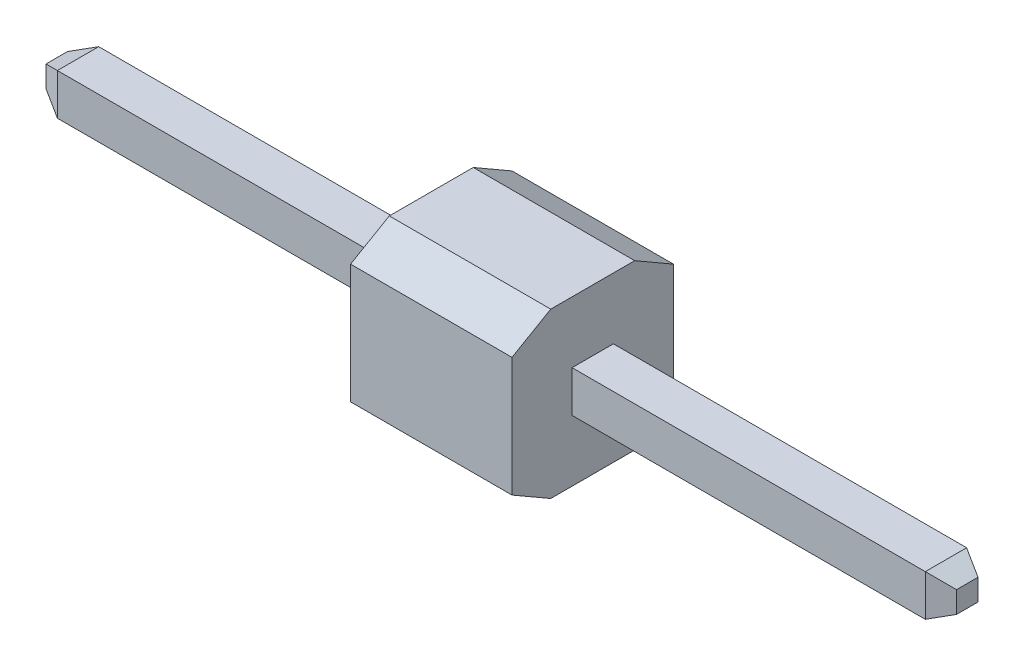
ISO-10303-21;
HEADER;
FILE_DESCRIPTION(('STEP AP214'),'2;1');
FILE_NAME('part.step','',(''),(''),'','','');
FILE_SCHEMA(('AUTOMOTIVE_DESIGN { 1 0 10303 214 1 1 1 1 }'));
ENDSEC;
DATA;
#1=APPLICATION_CONTEXT('core data for automotive mechanical design processes');
#2=APPLICATION_PROTOCOL_DEFINITION('international standard','automotive_design',2000,#1);
#3=PRODUCT_CONTEXT('',#1,'mechanical');
#4=PRODUCT('Part','Part','',(#3));
#5=PRODUCT_RELATED_PRODUCT_CATEGORY('part','',(#4));
#6=PRODUCT_DEFINITION_FORMATION('','',#4);
#7=PRODUCT_DEFINITION_CONTEXT('part definition',#1,'design');
#8=PRODUCT_DEFINITION('design','',#6,#7);
#9=PRODUCT_DEFINITION_SHAPE('','',#8);
#10=(LENGTH_UNIT() NAMED_UNIT(*) SI_UNIT(.MILLI.,.METRE.));
#11=(NAMED_UNIT(*) PLANE_ANGLE_UNIT() SI_UNIT($,.RADIAN.));
#12=(NAMED_UNIT(*) SI_UNIT($,.STERADIAN.) SOLID_ANGLE_UNIT());
#13=UNCERTAINTY_MEASURE_WITH_UNIT(LENGTH_MEASURE(1.E-05),#10,'distance_accuracy_value','');
#14=(GEOMETRIC_REPRESENTATION_CONTEXT(3) GLOBAL_UNCERTAINTY_ASSIGNED_CONTEXT((#13)) GLOBAL_UNIT_ASSIGNED_CONTEXT((#10,
#11,#12)) REPRESENTATION_CONTEXT('',''));
#15=CARTESIAN_POINT('',(0.,0.,0.));
#16=DIRECTION('',(0.,0.,1.));
#17=DIRECTION('',(1.,0.,0.));
#18=AXIS2_PLACEMENT_3D('',#15,#16,#17);
#19=CARTESIAN_POINT('',(5.42107550068064,-13.0171282629139,0.629998634255617));
#20=DIRECTION('',(1.,4.37113882867379E-08,-4.37113882867379E-08));
#21=DIRECTION('',(-4.37113882867379E-08,1.,0.));
#22=AXIS2_PLACEMENT_3D('',#19,#20,#21);
#23=PLANE('',#22);
#24=DIRECTION('',(1.59994777304463E-08,0.50000000000019,0.866025403784329));
#25=VECTOR('',#24,1.);
#26=CARTESIAN_POINT('',(5.42107537769472,-11.7735384244239,-0.940001365744382));
#27=LINE('',#26,#25);
#28=CARTESIAN_POINT('',(5.42107537769472,-11.7735384244239,-0.940001365744382));
#29=VERTEX_POINT('',#28);
#30=CARTESIAN_POINT('',(5.42107538877949,-11.4271282629139,-0.340001365744383));
#31=VERTEX_POINT('',#30);
#32=EDGE_CURVE('E11',#29,#31,#27,.T.);
#33=ORIENTED_EDGE('',*,*,#32,.T.);
#34=DIRECTION('',(4.37113880134522E-08,0.,0.999999999999999));
#35=VECTOR('',#34,1.);
#36=CARTESIAN_POINT('',(5.42107538877949,-11.4271282629139,-0.340001365744383));
#37=LINE('',#36,#35);
#38=CARTESIAN_POINT('',(5.42107544560429,-11.4271282629139,0.959998634255618));
#39=VERTEX_POINT('',#38);
#40=EDGE_CURVE('E304',#31,#39,#37,.T.);
#41=ORIENTED_EDGE('',*,*,#40,.T.);
#42=DIRECTION('',(5.97108681645512E-08,-0.500000000000186,0.86602540378433));
#43=VECTOR('',#42,1.);
#44=CARTESIAN_POINT('',(5.42107544560429,-11.4271282629139,0.959998634255618));
#45=LINE('',#44,#43);
#46=CARTESIAN_POINT('',(5.42107548697319,-11.7735384244239,1.55999863425562));
#47=VERTEX_POINT('',#46);
#48=EDGE_CURVE('E296',#39,#47,#45,.T.);
#49=ORIENTED_EDGE('',*,*,#48,.T.);
#50=DIRECTION('',(4.37113884815545E-08,-0.999999999999999,0.));
#51=VECTOR('',#50,1.);
#52=CARTESIAN_POINT('',(5.42107548697319,-11.7735384244239,1.55999863425562));
#53=LINE('',#52,#51);
#54=CARTESIAN_POINT('',(5.42107556771598,-13.6207181013939,1.55999863425562));
#55=VERTEX_POINT('',#54);
#56=EDGE_CURVE('E281',#47,#55,#53,.T.);
#57=ORIENTED_EDGE('',*,*,#56,.T.);
#58=DIRECTION('',(1.59994802942811E-08,0.500000000000195,0.866025403784326));
#59=VECTOR('',#58,1.);
#60=CARTESIAN_POINT('',(5.42107555663122,-13.9671282629139,0.959998634255618));
#61=LINE('',#60,#59);
#62=CARTESIAN_POINT('',(5.42107555663122,-13.9671282629139,0.959998634255618));
#63=VERTEX_POINT('',#62);
#64=EDGE_CURVE('E265',#63,#55,#61,.T.);
#65=ORIENTED_EDGE('',*,*,#64,.F.);
#66=DIRECTION('',(4.37113880134522E-08,0.,0.999999999999999));
#67=VECTOR('',#66,1.);
#68=CARTESIAN_POINT('',(5.42107549980641,-13.9671282629139,-0.340001365744383));
#69=LINE('',#68,#67);
#70=CARTESIAN_POINT('',(5.42107549980641,-13.9671282629139,-0.340001365744383));
#71=VERTEX_POINT('',#70);
#72=EDGE_CURVE('E248',#71,#63,#69,.T.);
#73=ORIENTED_EDGE('',*,*,#72,.F.);
#74=DIRECTION('',(5.97108656001698E-08,-0.50000000000019,0.866025403784327));
#75=VECTOR('',#74,1.);
#76=CARTESIAN_POINT('',(5.42107545843751,-13.6207181013939,-0.940001365744382));
#77=LINE('',#76,#75);
#78=CARTESIAN_POINT('',(5.42107545843751,-13.6207181013939,-0.940001365744382));
#79=VERTEX_POINT('',#78);
#80=EDGE_CURVE('E242',#79,#71,#77,.T.);
#81=ORIENTED_EDGE('',*,*,#80,.F.);
#82=DIRECTION('',(4.37113884815545E-08,-0.999999999999999,0.));
#83=VECTOR('',#82,1.);
#84=CARTESIAN_POINT('',(5.42107537769472,-11.7735384244239,-0.940001365744382));
#85=LINE('',#84,#83);
#86=EDGE_CURVE('E236',#29,#79,#85,.T.);
#87=ORIENTED_EDGE('',*,*,#86,.F.);
#88=EDGE_LOOP('',(#33,#41,#49,#57,#65,#73,#81,#87));
#89=FACE_BOUND('',#88,.T.);
#90=DIRECTION('',(-4.37113872875372E-08,0.,-0.999999999999999));
#91=VECTOR('',#90,1.);
#92=CARTESIAN_POINT('',(5.42107547270535,-12.3771282629139,0.629998634255617));
#93=LINE('',#92,#91);
#94=CARTESIAN_POINT('',(5.42107547270535,-12.3771282629139,0.629998634255617));
#95=VERTEX_POINT('',#94);
#96=CARTESIAN_POINT('',(5.42107544473006,-12.3771282629139,-0.0100013657443826));
#97=VERTEX_POINT('',#96);
#98=EDGE_CURVE('E302',#95,#97,#93,.T.);
#99=ORIENTED_EDGE('',*,*,#98,.T.);
#100=DIRECTION('',(-4.37113872875374E-08,0.999999999999999,0.));
#101=VECTOR('',#100,1.);
#102=CARTESIAN_POINT('',(5.42107547270535,-13.0171282629139,-0.0100013657443826));
#103=LINE('',#102,#101);
#104=CARTESIAN_POINT('',(5.42107547270535,-13.0171282629139,-0.0100013657443826));
#105=VERTEX_POINT('',#104);
#106=EDGE_CURVE('E293',#105,#97,#103,.T.);
#107=ORIENTED_EDGE('',*,*,#106,.F.);
#108=DIRECTION('',(-4.37113886753159E-08,0.,-0.999999999999999));
#109=VECTOR('',#108,1.);
#110=CARTESIAN_POINT('',(5.42107550068064,-13.0171282629139,0.629998634255617));
#111=LINE('',#110,#109);
#112=CARTESIAN_POINT('',(5.42107550068064,-13.0171282629139,0.629998634255617));
#113=VERTEX_POINT('',#112);
#114=EDGE_CURVE('E278',#113,#105,#111,.T.);
#115=ORIENTED_EDGE('',*,*,#114,.F.);
#116=DIRECTION('',(-4.37113886753161E-08,0.999999999999999,0.));
#117=VECTOR('',#116,1.);
#118=CARTESIAN_POINT('',(5.42107550068064,-13.0171282629139,0.629998634255617));
#119=LINE('',#118,#117);
#120=EDGE_CURVE('E263',#113,#95,#119,.T.);
#121=ORIENTED_EDGE('',*,*,#120,.T.);
#122=EDGE_LOOP('',(#99,#107,#115,#121));
#123=FACE_BOUND('',#122,.T.);
#124=ADVANCED_FACE('F17',(#89,#123),#23,.T.);
#125=CARTESIAN_POINT('',(2.92107550068064,-13.0171283721924,0.629998743534088));
#126=DIRECTION('',(1.,4.37113882867379E-08,-4.37113882867379E-08));
#127=DIRECTION('',(-4.37113882867379E-08,1.,0.));
#128=AXIS2_PLACEMENT_3D('',#125,#126,#127);
#129=PLANE('',#128);
#130=DIRECTION('',(1.59994790124215E-08,0.50000000000019,0.866025403784329));
#131=VECTOR('',#130,1.);
#132=CARTESIAN_POINT('',(2.92107537769472,-11.7735385337024,-0.940001256465912));
#133=LINE('',#132,#131);
#134=CARTESIAN_POINT('',(2.92107537769472,-11.7735385337024,-0.940001256465912));
#135=VERTEX_POINT('',#134);
#136=CARTESIAN_POINT('',(2.92107538877949,-11.4271283721924,-0.340001256465912));
#137=VERTEX_POINT('',#136);
#138=EDGE_CURVE('E24',#135,#137,#133,.T.);
#139=ORIENTED_EDGE('',*,*,#138,.F.);
#140=DIRECTION('',(4.37113884815545E-08,-0.999999999999999,0.));
#141=VECTOR('',#140,1.);
#142=CARTESIAN_POINT('',(2.92107537769472,-11.7735385337024,-0.940001256465912));
#143=LINE('',#142,#141);
#144=CARTESIAN_POINT('',(2.92107545843751,-13.6207182106724,-0.940001256465912));
#145=VERTEX_POINT('',#144);
#146=EDGE_CURVE('E300',#135,#145,#143,.T.);
#147=ORIENTED_EDGE('',*,*,#146,.T.);
#148=DIRECTION('',(5.97108662411574E-08,-0.50000000000019,0.866025403784327));
#149=VECTOR('',#148,1.);
#150=CARTESIAN_POINT('',(2.92107545843751,-13.6207182106724,-0.940001256465912));
#151=LINE('',#150,#149);
#152=CARTESIAN_POINT('',(2.92107549980641,-13.9671283721924,-0.340001256465912));
#153=VERTEX_POINT('',#152);
#154=EDGE_CURVE('E286',#145,#153,#151,.T.);
#155=ORIENTED_EDGE('',*,*,#154,.T.);
#156=DIRECTION('',(4.37113883550593E-08,0.,0.999999999999999));
#157=VECTOR('',#156,1.);
#158=CARTESIAN_POINT('',(2.92107549980641,-13.9671283721924,-0.340001256465912));
#159=LINE('',#158,#157);
#160=CARTESIAN_POINT('',(2.92107555663122,-13.9671283721924,0.959998743534088));
#161=VERTEX_POINT('',#160);
#162=EDGE_CURVE('E271',#153,#161,#159,.T.);
#163=ORIENTED_EDGE('',*,*,#162,.T.);
#164=DIRECTION('',(1.59994790123059E-08,0.500000000000195,0.866025403784326));
#165=VECTOR('',#164,1.);
#166=CARTESIAN_POINT('',(2.92107555663122,-13.9671283721924,0.959998743534088));
#167=LINE('',#166,#165);
#168=CARTESIAN_POINT('',(2.92107556771598,-13.6207182106724,1.55999874353409));
#169=VERTEX_POINT('',#168);
#170=EDGE_CURVE('E253',#161,#169,#167,.T.);
#171=ORIENTED_EDGE('',*,*,#170,.T.);
#172=DIRECTION('',(4.37113884815545E-08,-0.999999999999999,0.));
#173=VECTOR('',#172,1.);
#174=CARTESIAN_POINT('',(2.92107548697319,-11.7735385337024,1.55999874353409));
#175=LINE('',#174,#173);
#176=CARTESIAN_POINT('',(2.92107548697319,-11.7735385337024,1.55999874353409));
#177=VERTEX_POINT('',#176);
#178=EDGE_CURVE('E261',#177,#169,#175,.T.);
#179=ORIENTED_EDGE('',*,*,#178,.F.);
#180=DIRECTION('',(5.97108668825761E-08,-0.500000000000186,0.86602540378433));
#181=VECTOR('',#180,1.);
#182=CARTESIAN_POINT('',(2.92107544560429,-11.4271283721924,0.959998743534088));
#183=LINE('',#182,#181);
#184=CARTESIAN_POINT('',(2.92107544560429,-11.4271283721924,0.959998743534088));
#185=VERTEX_POINT('',#184);
#186=EDGE_CURVE('E276',#185,#177,#183,.T.);
#187=ORIENTED_EDGE('',*,*,#186,.F.);
#188=DIRECTION('',(4.37113880134522E-08,0.,0.999999999999999));
#189=VECTOR('',#188,1.);
#190=CARTESIAN_POINT('',(2.92107538877949,-11.4271283721924,-0.340001256465912));
#191=LINE('',#190,#189);
#192=EDGE_CURVE('E291',#137,#185,#191,.T.);
#193=ORIENTED_EDGE('',*,*,#192,.F.);
#194=EDGE_LOOP('',(#139,#147,#155,#163,#171,#179,#187,#193));
#195=FACE_BOUND('',#194,.T.);
#196=DIRECTION('',(-4.37113879814267E-08,0.999999999999999,0.));
#197=VECTOR('',#196,1.);
#198=CARTESIAN_POINT('',(2.92107547270535,-13.0171283721924,-0.0100012564659119));
#199=LINE('',#198,#197);
#200=CARTESIAN_POINT('',(2.92107547270535,-13.0171283721924,-0.0100012564659119));
#201=VERTEX_POINT('',#200);
#202=CARTESIAN_POINT('',(2.92107544473006,-12.3771283721924,-0.0100012564659119));
#203=VERTEX_POINT('',#202);
#204=EDGE_CURVE('E298',#201,#203,#199,.T.);
#205=ORIENTED_EDGE('',*,*,#204,.T.);
#206=DIRECTION('',(-4.37113879814266E-08,0.,-0.999999999999999));
#207=VECTOR('',#206,1.);
#208=CARTESIAN_POINT('',(2.92107547270535,-12.3771283721924,0.629998743534088));
#209=LINE('',#208,#207);
#210=CARTESIAN_POINT('',(2.92107547270535,-12.3771283721924,0.629998743534088));
#211=VERTEX_POINT('',#210);
#212=EDGE_CURVE('E283',#211,#203,#209,.T.);
#213=ORIENTED_EDGE('',*,*,#212,.F.);
#214=DIRECTION('',(-4.37113879814267E-08,0.999999999999999,0.));
#215=VECTOR('',#214,1.);
#216=CARTESIAN_POINT('',(2.92107550068064,-13.0171283721924,0.629998743534088));
#217=LINE('',#216,#215);
#218=CARTESIAN_POINT('',(2.92107550068064,-13.0171283721924,0.629998743534088));
#219=VERTEX_POINT('',#218);
#220=EDGE_CURVE('E268',#219,#211,#217,.T.);
#221=ORIENTED_EDGE('',*,*,#220,.F.);
#222=DIRECTION('',(-4.37113879814266E-08,0.,-0.999999999999999));
#223=VECTOR('',#222,1.);
#224=CARTESIAN_POINT('',(2.92107550068064,-13.0171283721924,0.629998743534088));
#225=LINE('',#224,#223);
#226=EDGE_CURVE('E251',#219,#201,#225,.T.);
#227=ORIENTED_EDGE('',*,*,#226,.T.);
#228=EDGE_LOOP('',(#205,#213,#221,#227));
#229=FACE_BOUND('',#228,.T.);
#230=ADVANCED_FACE('F314',(#195,#229),#129,.F.);
#231=CARTESIAN_POINT('',(5.42107537769472,-11.7735384244239,-0.940001365744382));
#232=DIRECTION('',(5.97108668343731E-08,-0.866025403784328,0.50000000000019));
#233=DIRECTION('',(-1.59994785476185E-08,-0.500000000000192,-0.866025403784329));
#234=AXIS2_PLACEMENT_3D('',#231,#232,#233);
#235=PLANE('',#234);
#236=ORIENTED_EDGE('',*,*,#138,.T.);
#237=DIRECTION('',(-0.999999999999998,-4.37113897078233E-08,4.37113883755557E-08));
#238=VECTOR('',#237,1.);
#239=CARTESIAN_POINT('',(5.42107538877949,-11.4271282629139,-0.340001365744383));
#240=LINE('',#239,#238);
#241=EDGE_CURVE('E288',#31,#137,#240,.T.);
#242=ORIENTED_EDGE('',*,*,#241,.F.);
#243=ORIENTED_EDGE('',*,*,#32,.F.);
#244=DIRECTION('',(-0.999999999999998,-4.37113868656524E-08,4.37113881091021E-08));
#245=VECTOR('',#244,1.);
#246=CARTESIAN_POINT('',(5.42107537769472,-11.7735384244239,-0.940001365744382));
#247=LINE('',#246,#245);
#248=EDGE_CURVE('E256',#29,#135,#247,.T.);
#249=ORIENTED_EDGE('',*,*,#248,.T.);
#250=EDGE_LOOP('',(#236,#242,#243,#249));
#251=FACE_BOUND('',#250,.T.);
#252=ADVANCED_FACE('F306',(#251),#235,.F.);
#253=CARTESIAN_POINT('',(5.42107538877949,-11.4271282629139,-0.340001365744383));
#254=DIRECTION('',(4.37113882867379E-08,-1.,0.));
#255=DIRECTION('',(1.,4.37113882867379E-08,-4.37113882867379E-08));
#256=AXIS2_PLACEMENT_3D('',#253,#254,#255);
#257=PLANE('',#256);
#258=ORIENTED_EDGE('',*,*,#192,.T.);
#259=DIRECTION('',(-0.999999999999998,-4.37113897078233E-08,4.37113882867378E-08));
#260=VECTOR('',#259,1.);
#261=CARTESIAN_POINT('',(5.42107544560429,-11.4271282629139,0.959998634255618));
#262=LINE('',#261,#260);
#263=EDGE_CURVE('E273',#39,#185,#262,.T.);
#264=ORIENTED_EDGE('',*,*,#263,.F.);
#265=ORIENTED_EDGE('',*,*,#40,.F.);
#266=ORIENTED_EDGE('',*,*,#241,.T.);
#267=EDGE_LOOP('',(#258,#264,#265,#266));
#268=FACE_BOUND('',#267,.T.);
#269=ADVANCED_FACE('F311',(#268),#257,.F.);
#270=CARTESIAN_POINT('',(5.42107544560429,-11.4271282629139,0.959998634255618));
#271=DIRECTION('',(1.59994785476185E-08,-0.86602540378433,-0.50000000000019));
#272=DIRECTION('',(-5.97108668343731E-08,0.500000000000188,-0.866025403784329));
#273=AXIS2_PLACEMENT_3D('',#270,#271,#272);
#274=PLANE('',#273);
#275=ORIENTED_EDGE('',*,*,#186,.T.);
#276=DIRECTION('',(-0.999999999999998,-4.37113868656524E-08,4.37113882867378E-08));
#277=VECTOR('',#276,1.);
#278=CARTESIAN_POINT('',(5.42107548697319,-11.7735384244239,1.55999863425562));
#279=LINE('',#278,#277);
#280=EDGE_CURVE('E258',#47,#177,#279,.T.);
#281=ORIENTED_EDGE('',*,*,#280,.F.);
#282=ORIENTED_EDGE('',*,*,#48,.F.);
#283=ORIENTED_EDGE('',*,*,#263,.T.);
#284=EDGE_LOOP('',(#275,#281,#282,#283));
#285=FACE_BOUND('',#284,.T.);
#286=ADVANCED_FACE('F319',(#285),#274,.F.);
#287=CARTESIAN_POINT('',(5.42107548697319,-11.7735384244239,1.55999863425562));
#288=DIRECTION('',(-4.37113882867379E-08,0.,-1.));
#289=DIRECTION('',(-1.,-4.37113882867379E-08,4.37113882867379E-08));
#290=AXIS2_PLACEMENT_3D('',#287,#288,#289);
#291=PLANE('',#290);
#292=ORIENTED_EDGE('',*,*,#178,.T.);
#293=DIRECTION('',(-0.999999999999998,-4.37113897078233E-08,4.37113882867378E-08));
#294=VECTOR('',#293,1.);
#295=CARTESIAN_POINT('',(5.42107556771598,-13.6207181013939,1.55999863425562));
#296=LINE('',#295,#294);
#297=EDGE_CURVE('E245',#55,#169,#296,.T.);
#298=ORIENTED_EDGE('',*,*,#297,.F.);
#299=ORIENTED_EDGE('',*,*,#56,.F.);
#300=ORIENTED_EDGE('',*,*,#280,.T.);
#301=EDGE_LOOP('',(#292,#298,#299,#300));
#302=FACE_BOUND('',#301,.T.);
#303=ADVANCED_FACE('F326',(#302),#291,.F.);
#304=CARTESIAN_POINT('',(5.42107555663122,-13.9671282629139,0.959998634255618));
#305=DIRECTION('',(5.97108668343731E-08,-0.866025403784328,0.50000000000019));
#306=DIRECTION('',(-1.59994785476185E-08,-0.500000000000192,-0.866025403784329));
#307=AXIS2_PLACEMENT_3D('',#304,#305,#306);
#308=PLANE('',#307);
#309=ORIENTED_EDGE('',*,*,#170,.F.);
#310=DIRECTION('',(-0.999999999999998,-4.37113854445669E-08,4.37113882867378E-08));
#311=VECTOR('',#310,1.);
#312=CARTESIAN_POINT('',(5.42107555663122,-13.9671282629139,0.959998634255618));
#313=LINE('',#312,#311);
#314=EDGE_CURVE('E239',#63,#161,#313,.T.);
#315=ORIENTED_EDGE('',*,*,#314,.F.);
#316=ORIENTED_EDGE('',*,*,#64,.T.);
#317=ORIENTED_EDGE('',*,*,#297,.T.);
#318=EDGE_LOOP('',(#309,#315,#316,#317));
#319=FACE_BOUND('',#318,.T.);
#320=ADVANCED_FACE('F329',(#319),#308,.T.);
#321=CARTESIAN_POINT('',(5.42107549980641,-13.9671282629139,-0.340001365744383));
#322=DIRECTION('',(4.37113882867379E-08,-1.,0.));
#323=DIRECTION('',(1.,4.37113882867379E-08,-4.37113882867379E-08));
#324=AXIS2_PLACEMENT_3D('',#321,#322,#323);
#325=PLANE('',#324);
#326=ORIENTED_EDGE('',*,*,#162,.F.);
#327=DIRECTION('',(-0.999999999999998,-4.37113854445669E-08,4.37113883755557E-08));
#328=VECTOR('',#327,1.);
#329=CARTESIAN_POINT('',(5.42107549980641,-13.9671282629139,-0.340001365744383));
#330=LINE('',#329,#328);
#331=EDGE_CURVE('E233',#71,#153,#330,.T.);
#332=ORIENTED_EDGE('',*,*,#331,.F.);
#333=ORIENTED_EDGE('',*,*,#72,.T.);
#334=ORIENTED_EDGE('',*,*,#314,.T.);
#335=EDGE_LOOP('',(#326,#332,#333,#334));
#336=FACE_BOUND('',#335,.T.);
#337=ADVANCED_FACE('F333',(#336),#325,.T.);
#338=CARTESIAN_POINT('',(5.42107545843751,-13.6207181013939,-0.940001365744382));
#339=DIRECTION('',(1.59994785476185E-08,-0.86602540378433,-0.50000000000019));
#340=DIRECTION('',(-5.97108668343731E-08,0.500000000000188,-0.866025403784329));
#341=AXIS2_PLACEMENT_3D('',#338,#339,#340);
#342=PLANE('',#341);
#343=ORIENTED_EDGE('',*,*,#154,.F.);
#344=DIRECTION('',(-0.999999999999998,-4.37113897078233E-08,4.37113881091021E-08));
#345=VECTOR('',#344,1.);
#346=CARTESIAN_POINT('',(5.42107545843751,-13.6207181013939,-0.940001365744382));
#347=LINE('',#346,#345);
#348=EDGE_CURVE('E230',#79,#145,#347,.T.);
#349=ORIENTED_EDGE('',*,*,#348,.F.);
#350=ORIENTED_EDGE('',*,*,#80,.T.);
#351=ORIENTED_EDGE('',*,*,#331,.T.);
#352=EDGE_LOOP('',(#343,#349,#350,#351));
#353=FACE_BOUND('',#352,.T.);
#354=ADVANCED_FACE('F337',(#353),#342,.T.);
#355=CARTESIAN_POINT('',(5.42107537769472,-11.7735384244239,-0.940001365744382));
#356=DIRECTION('',(-4.37113882867379E-08,0.,-1.));
#357=DIRECTION('',(-4.37113882867379E-08,1.,0.));
#358=AXIS2_PLACEMENT_3D('',#355,#356,#357);
#359=PLANE('',#358);
#360=ORIENTED_EDGE('',*,*,#146,.F.);
#361=ORIENTED_EDGE('',*,*,#248,.F.);
#362=ORIENTED_EDGE('',*,*,#86,.T.);
#363=ORIENTED_EDGE('',*,*,#348,.T.);
#364=EDGE_LOOP('',(#360,#361,#362,#363));
#365=FACE_BOUND('',#364,.T.);
#366=ADVANCED_FACE('F339',(#365),#359,.T.);
#367=CARTESIAN_POINT('',(-2.87892449931936,-13.0171286257184,0.62999899706014));
#368=DIRECTION('',(-1.,-4.37113882867379E-08,4.37113882867379E-08));
#369=DIRECTION('',(4.37113882867379E-08,-1.,0.));
#370=AXIS2_PLACEMENT_3D('',#367,#368,#369);
#371=PLANE('',#370);
#372=DIRECTION('',(4.37113900757526E-08,-0.999999999999999,0.));
#373=VECTOR('',#372,1.);
#374=CARTESIAN_POINT('',(-2.87892454181719,-12.5310101529084,0.14388052425114));
#375=LINE('',#374,#373);
#376=CARTESIAN_POINT('',(-2.87892454181719,-12.5310101529084,0.14388052425114));
#377=VERTEX_POINT('',#376);
#378=CARTESIAN_POINT('',(-2.87892452729465,-12.8632470985184,0.14388052425114));
#379=VERTEX_POINT('',#378);
#380=EDGE_CURVE('E228',#377,#379,#375,.T.);
#381=ORIENTED_EDGE('',*,*,#380,.T.);
#382=DIRECTION('',(4.37113900746999E-08,0.,0.999999999999999));
#383=VECTOR('',#382,1.);
#384=CARTESIAN_POINT('',(-2.87892452729465,-12.8632470985184,0.14388052425114));
#385=LINE('',#384,#383);
#386=CARTESIAN_POINT('',(-2.87892451277211,-12.8632470985184,0.47611746986914));
#387=VERTEX_POINT('',#386);
#388=EDGE_CURVE('E223',#379,#387,#385,.T.);
#389=ORIENTED_EDGE('',*,*,#388,.T.);
#390=DIRECTION('',(-4.37113874024243E-08,0.999999999999999,0.));
#391=VECTOR('',#390,1.);
#392=CARTESIAN_POINT('',(-2.87892451277211,-12.8632470985184,0.47611746986914));
#393=LINE('',#392,#391);
#394=CARTESIAN_POINT('',(-2.87892452729465,-12.5310101529084,0.47611746986914));
#395=VERTEX_POINT('',#394);
#396=EDGE_CURVE('E215',#387,#395,#393,.T.);
#397=ORIENTED_EDGE('',*,*,#396,.T.);
#398=DIRECTION('',(-4.37113820547151E-08,0.,-0.999999999999999));
#399=VECTOR('',#398,1.);
#400=CARTESIAN_POINT('',(-2.87892452729465,-12.5310101529084,0.47611746986914));
#401=LINE('',#400,#399);
#402=EDGE_CURVE('E207',#395,#377,#401,.T.);
#403=ORIENTED_EDGE('',*,*,#402,.T.);
#404=EDGE_LOOP('',(#381,#389,#397,#403));
#405=FACE_BOUND('',#404,.T.);
#406=ADVANCED_FACE('F341',(#405),#371,.T.);
#407=CARTESIAN_POINT('',(-2.87892449931936,-13.0171286257184,0.62999899706014));
#408=DIRECTION('',(4.37113882867379E-08,-1.,0.));
#409=DIRECTION('',(-4.37113882867379E-08,0.,-1.));
#410=AXIS2_PLACEMENT_3D('',#407,#408,#409);
#411=PLANE('',#410);
#412=DIRECTION('',(0.999999999999998,4.37113868968279E-08,-4.37113882769955E-08));
#413=VECTOR('',#412,1.);
#414=CARTESIAN_POINT('',(-2.54892449931936,-13.0171286112937,0.629998982635382));
#415=LINE('',#414,#413);
#416=CARTESIAN_POINT('',(-2.54892449931936,-13.0171286112937,0.629998982635382));
#417=VERTEX_POINT('',#416);
#418=EDGE_CURVE('E225',#417,#219,#415,.T.);
#419=ORIENTED_EDGE('',*,*,#418,.F.);
#420=DIRECTION('',(-4.37113886753159E-08,0.,-0.999999999999999));
#421=VECTOR('',#420,1.);
#422=CARTESIAN_POINT('',(-2.54892449931936,-13.0171286112937,0.629998982635382));
#423=LINE('',#422,#421);
#424=CARTESIAN_POINT('',(-2.54892452729465,-13.0171286112937,-0.010001017364618));
#425=VERTEX_POINT('',#424);
#426=EDGE_CURVE('E217',#417,#425,#423,.T.);
#427=ORIENTED_EDGE('',*,*,#426,.T.);
#428=DIRECTION('',(0.999999999999998,4.37113868968279E-08,-4.37113882161057E-08));
#429=VECTOR('',#428,1.);
#430=CARTESIAN_POINT('',(-2.54892452729465,-13.0171286112937,-0.010001017364618));
#431=LINE('',#430,#429);
#432=EDGE_CURVE('E220',#425,#201,#431,.T.);
#433=ORIENTED_EDGE('',*,*,#432,.T.);
#434=ORIENTED_EDGE('',*,*,#226,.F.);
#435=EDGE_LOOP('',(#419,#427,#433,#434));
#436=FACE_BOUND('',#435,.T.);
#437=ADVANCED_FACE('F348',(#436),#411,.T.);
#438=CARTESIAN_POINT('',(-2.87892452729465,-13.0171286257184,-0.0100010029398598));
#439=DIRECTION('',(-4.37113882867379E-08,0.,-1.));
#440=DIRECTION('',(-1.,-4.37113882867379E-08,4.37113882867379E-08));
#441=AXIS2_PLACEMENT_3D('',#438,#439,#440);
#442=PLANE('',#441);
#443=ORIENTED_EDGE('',*,*,#432,.F.);
#444=DIRECTION('',(-4.37113872875374E-08,0.999999999999999,0.));
#445=VECTOR('',#444,1.);
#446=CARTESIAN_POINT('',(-2.54892452729465,-13.0171286112937,-0.010001017364618));
#447=LINE('',#446,#445);
#448=CARTESIAN_POINT('',(-2.54892455526994,-12.3771286112937,-0.010001017364618));
#449=VERTEX_POINT('',#448);
#450=EDGE_CURVE('E209',#425,#449,#447,.T.);
#451=ORIENTED_EDGE('',*,*,#450,.T.);
#452=DIRECTION('',(0.999999999999998,4.37113868968279E-08,-4.37113882161057E-08));
#453=VECTOR('',#452,1.);
#454=CARTESIAN_POINT('',(-2.54892455526994,-12.3771286112937,-0.010001017364618));
#455=LINE('',#454,#453);
#456=EDGE_CURVE('E212',#449,#203,#455,.T.);
#457=ORIENTED_EDGE('',*,*,#456,.T.);
#458=ORIENTED_EDGE('',*,*,#204,.F.);
#459=EDGE_LOOP('',(#443,#451,#457,#458));
#460=FACE_BOUND('',#459,.T.);
#461=ADVANCED_FACE('F424',(#460),#442,.T.);
#462=CARTESIAN_POINT('',(-2.87892452729465,-12.3771286257184,0.62999899706014));
#463=DIRECTION('',(4.37113882867379E-08,-1.,0.));
#464=DIRECTION('',(-4.37113882867379E-08,0.,-1.));
#465=AXIS2_PLACEMENT_3D('',#462,#463,#464);
#466=PLANE('',#465);
#467=ORIENTED_EDGE('',*,*,#456,.F.);
#468=DIRECTION('',(4.37113886753159E-08,0.,0.999999999999999));
#469=VECTOR('',#468,1.);
#470=CARTESIAN_POINT('',(-2.54892455526994,-12.3771286112937,-0.010001017364618));
#471=LINE('',#470,#469);
#472=CARTESIAN_POINT('',(-2.54892452729465,-12.3771286112937,0.629998982635382));
#473=VERTEX_POINT('',#472);
#474=EDGE_CURVE('E201',#449,#473,#471,.T.);
#475=ORIENTED_EDGE('',*,*,#474,.T.);
#476=DIRECTION('',(0.999999999999998,4.37113868968279E-08,-4.37113882769955E-08));
#477=VECTOR('',#476,1.);
#478=CARTESIAN_POINT('',(-2.54892452729465,-12.3771286112937,0.629998982635382));
#479=LINE('',#478,#477);
#480=EDGE_CURVE('E204',#473,#211,#479,.T.);
#481=ORIENTED_EDGE('',*,*,#480,.T.);
#482=ORIENTED_EDGE('',*,*,#212,.T.);
#483=EDGE_LOOP('',(#467,#475,#481,#482));
#484=FACE_BOUND('',#483,.T.);
#485=ADVANCED_FACE('F421',(#484),#466,.F.);
#486=CARTESIAN_POINT('',(-2.87892449931936,-13.0171286257184,0.62999899706014));
#487=DIRECTION('',(-4.37113882867379E-08,0.,-1.));
#488=DIRECTION('',(-1.,-4.37113882867379E-08,4.37113882867379E-08));
#489=AXIS2_PLACEMENT_3D('',#486,#487,#488);
#490=PLANE('',#489);
#491=ORIENTED_EDGE('',*,*,#480,.F.);
#492=DIRECTION('',(4.37113872875374E-08,-0.999999999999999,0.));
#493=VECTOR('',#492,1.);
#494=CARTESIAN_POINT('',(-2.54892452729465,-12.3771286112937,0.629998982635382));
#495=LINE('',#494,#493);
#496=EDGE_CURVE('E196',#473,#417,#495,.T.);
#497=ORIENTED_EDGE('',*,*,#496,.T.);
#498=ORIENTED_EDGE('',*,*,#418,.T.);
#499=ORIENTED_EDGE('',*,*,#220,.T.);
#500=EDGE_LOOP('',(#491,#497,#498,#499));
#501=FACE_BOUND('',#500,.T.);
#502=ADVANCED_FACE('F376',(#501),#490,.F.);
#503=CARTESIAN_POINT('',(-2.87892449931936,-13.0171286257184,0.62999899706014));
#504=DIRECTION('',(-4.37113882867379E-08,0.,-1.));
#505=DIRECTION('',(-1.,-4.37113882867379E-08,4.37113882867379E-08));
#506=AXIS2_PLACEMENT_3D('',#503,#504,#505);
#507=PLANE('',#506);
#508=DIRECTION('',(0.999999999999998,4.37113778039593E-08,-4.37113882769955E-08));
#509=VECTOR('',#508,1.);
#510=CARTESIAN_POINT('',(5.42107550068064,-13.0171282629139,0.629998634255617));
#511=LINE('',#510,#509);
#512=CARTESIAN_POINT('',(10.8910755006806,-13.0171280238126,0.629998395154324));
#513=VERTEX_POINT('',#512);
#514=EDGE_CURVE('E199',#113,#513,#511,.T.);
#515=ORIENTED_EDGE('',*,*,#514,.T.);
#516=DIRECTION('',(-4.37113872875374E-08,0.999999999999999,0.));
#517=VECTOR('',#516,1.);
#518=CARTESIAN_POINT('',(10.8910755006806,-13.0171280238126,0.629998395154324));
#519=LINE('',#518,#517);
#520=CARTESIAN_POINT('',(10.8910754727053,-12.3771280238126,0.629998395154324));
#521=VERTEX_POINT('',#520);
#522=EDGE_CURVE('E191',#513,#521,#519,.T.);
#523=ORIENTED_EDGE('',*,*,#522,.T.);
#524=DIRECTION('',(0.999999999999998,4.37113933917341E-08,-4.37113882769955E-08));
#525=VECTOR('',#524,1.);
#526=CARTESIAN_POINT('',(5.42107547270535,-12.3771282629139,0.629998634255617));
#527=LINE('',#526,#525);
#528=EDGE_CURVE('E194',#95,#521,#527,.T.);
#529=ORIENTED_EDGE('',*,*,#528,.F.);
#530=ORIENTED_EDGE('',*,*,#120,.F.);
#531=EDGE_LOOP('',(#515,#523,#529,#530));
#532=FACE_BOUND('',#531,.T.);
#533=ADVANCED_FACE('F367',(#532),#507,.F.);
#534=CARTESIAN_POINT('',(-2.87892452729465,-12.3771286257184,0.62999899706014));
#535=DIRECTION('',(4.37113882867379E-08,-1.,0.));
#536=DIRECTION('',(-4.37113882867379E-08,0.,-1.));
#537=AXIS2_PLACEMENT_3D('',#534,#535,#536);
#538=PLANE('',#537);
#539=ORIENTED_EDGE('',*,*,#528,.T.);
#540=DIRECTION('',(-4.37113872875372E-08,0.,-0.999999999999999));
#541=VECTOR('',#540,1.);
#542=CARTESIAN_POINT('',(10.8910754727053,-12.3771280238126,0.629998395154324));
#543=LINE('',#542,#541);
#544=CARTESIAN_POINT('',(10.8910754447301,-12.3771280238126,-0.0100016048456765));
#545=VERTEX_POINT('',#544);
#546=EDGE_CURVE('E186',#521,#545,#543,.T.);
#547=ORIENTED_EDGE('',*,*,#546,.T.);
#548=DIRECTION('',(0.999999999999998,4.37113933917341E-08,-4.37113881146228E-08));
#549=VECTOR('',#548,1.);
#550=CARTESIAN_POINT('',(5.42107544473006,-12.3771282629139,-0.0100013657443823));
#551=LINE('',#550,#549);
#552=EDGE_CURVE('E189',#97,#545,#551,.T.);
#553=ORIENTED_EDGE('',*,*,#552,.F.);
#554=ORIENTED_EDGE('',*,*,#98,.F.);
#555=EDGE_LOOP('',(#539,#547,#553,#554));
#556=FACE_BOUND('',#555,.T.);
#557=ADVANCED_FACE('F364',(#556),#538,.F.);
#558=CARTESIAN_POINT('',(-2.87892452729465,-13.0171286257184,-0.0100010029398598));
#559=DIRECTION('',(-4.37113882867379E-08,0.,-1.));
#560=DIRECTION('',(-1.,-4.37113882867379E-08,4.37113882867379E-08));
#561=AXIS2_PLACEMENT_3D('',#558,#559,#560);
#562=PLANE('',#561);
#563=ORIENTED_EDGE('',*,*,#552,.T.);
#564=DIRECTION('',(4.37113872875374E-08,-0.999999999999999,0.));
#565=VECTOR('',#564,1.);
#566=CARTESIAN_POINT('',(10.8910754447301,-12.3771280238126,-0.0100016048456765));
#567=LINE('',#566,#565);
#568=CARTESIAN_POINT('',(10.8910754727053,-13.0171280238126,-0.0100016048456765));
#569=VERTEX_POINT('',#568);
#570=EDGE_CURVE('E176',#545,#569,#567,.T.);
#571=ORIENTED_EDGE('',*,*,#570,.T.);
#572=DIRECTION('',(0.999999999999998,4.37113778039593E-08,-4.37113881146228E-08));
#573=VECTOR('',#572,1.);
#574=CARTESIAN_POINT('',(5.42107547270535,-13.0171282629139,-0.0100013657443823));
#575=LINE('',#574,#573);
#576=EDGE_CURVE('E179',#105,#569,#575,.T.);
#577=ORIENTED_EDGE('',*,*,#576,.F.);
#578=ORIENTED_EDGE('',*,*,#106,.T.);
#579=EDGE_LOOP('',(#563,#571,#577,#578));
#580=FACE_BOUND('',#579,.T.);
#581=ADVANCED_FACE('F366',(#580),#562,.T.);
#582=CARTESIAN_POINT('',(-2.87892449931936,-13.0171286257184,0.62999899706014));
#583=DIRECTION('',(4.37113882867379E-08,-1.,0.));
#584=DIRECTION('',(-4.37113882867379E-08,0.,-1.));
#585=AXIS2_PLACEMENT_3D('',#582,#583,#584);
#586=PLANE('',#585);
#587=ORIENTED_EDGE('',*,*,#576,.T.);
#588=DIRECTION('',(4.37113872875372E-08,0.,0.999999999999999));
#589=VECTOR('',#588,1.);
#590=CARTESIAN_POINT('',(10.8910754727054,-13.0171280238126,-0.0100016048456765));
#591=LINE('',#590,#589);
#592=EDGE_CURVE('E167',#569,#513,#591,.T.);
#593=ORIENTED_EDGE('',*,*,#592,.T.);
#594=ORIENTED_EDGE('',*,*,#514,.F.);
#595=ORIENTED_EDGE('',*,*,#114,.T.);
#596=EDGE_LOOP('',(#587,#593,#594,#595));
#597=FACE_BOUND('',#596,.T.);
#598=ADVANCED_FACE('F373',(#597),#586,.T.);
#599=CARTESIAN_POINT('',(11.2210755006806,-13.0171280093879,0.629998380729565));
#600=DIRECTION('',(-1.,-4.37113882867379E-08,4.37113882867379E-08));
#601=DIRECTION('',(4.37113882867379E-08,-1.,0.));
#602=AXIS2_PLACEMENT_3D('',#599,#600,#601);
#603=PLANE('',#602);
#604=DIRECTION('',(-4.37113874024243E-08,0.999999999999999,0.));
#605=VECTOR('',#604,1.);
#606=CARTESIAN_POINT('',(11.2210754727054,-12.8632464821879,0.143879907920565));
#607=LINE('',#606,#605);
#608=CARTESIAN_POINT('',(11.2210754727054,-12.8632464821879,0.143879907920565));
#609=VERTEX_POINT('',#608);
#610=CARTESIAN_POINT('',(11.2210754581828,-12.5310095365779,0.143879907920565));
#611=VERTEX_POINT('',#610);
#612=EDGE_CURVE('E153',#609,#611,#607,.T.);
#613=ORIENTED_EDGE('',*,*,#612,.T.);
#614=DIRECTION('',(4.37113874013716E-08,0.,0.999999999999999));
#615=VECTOR('',#614,1.);
#616=CARTESIAN_POINT('',(11.2210754581828,-12.5310095365779,0.143879907920565));
#617=LINE('',#616,#615);
#618=CARTESIAN_POINT('',(11.2210754727054,-12.5310095365779,0.476116853538565));
#619=VERTEX_POINT('',#618);
#620=EDGE_CURVE('E395',#611,#619,#617,.T.);
#621=ORIENTED_EDGE('',*,*,#620,.T.);
#622=DIRECTION('',(4.37113874024243E-08,-0.999999999999999,0.));
#623=VECTOR('',#622,1.);
#624=CARTESIAN_POINT('',(11.2210754727054,-12.5310095365779,0.476116853538565));
#625=LINE('',#624,#623);
#626=CARTESIAN_POINT('',(11.2210754872279,-12.8632464821879,0.476116853538565));
#627=VERTEX_POINT('',#626);
#628=EDGE_CURVE('E156',#619,#627,#625,.T.);
#629=ORIENTED_EDGE('',*,*,#628,.T.);
#630=DIRECTION('',(-4.37113927480282E-08,0.,-0.999999999999999));
#631=VECTOR('',#630,1.);
#632=CARTESIAN_POINT('',(11.2210754872279,-12.8632464821879,0.476116853538565));
#633=LINE('',#632,#631);
#634=EDGE_CURVE('E149',#627,#609,#633,.T.);
#635=ORIENTED_EDGE('',*,*,#634,.T.);
#636=EDGE_LOOP('',(#613,#621,#629,#635));
#637=FACE_BOUND('',#636,.T.);
#638=ADVANCED_FACE('F151',(#637),#603,.F.);
#639=CARTESIAN_POINT('',(-2.87892452056827,-12.5310101529084,0.62999899706014));
#640=DIRECTION('',(-0.422618301356784,0.906307768563367,1.84732310895534E-08));
#641=DIRECTION('',(4.37113882867379E-08,0.,1.));
#642=AXIS2_PLACEMENT_3D('',#639,#640,#641);
#643=PLANE('',#642);
#644=DIRECTION('',(0.834817095446925,0.389281657126021,-0.389281657126018));
#645=VECTOR('',#644,1.);
#646=CARTESIAN_POINT('',(-2.8789245418172,-12.5310101529079,0.143880524251623));
#647=LINE('',#646,#645);
#648=EDGE_CURVE('E181',#377,#449,#647,.T.);
#649=ORIENTED_EDGE('',*,*,#648,.F.);
#650=ORIENTED_EDGE('',*,*,#402,.F.);
#651=DIRECTION('',(-0.834817129479003,-0.389281657126029,-0.389281584143985));
#652=VECTOR('',#651,1.);
#653=CARTESIAN_POINT('',(-2.54892452729508,-12.3771286112922,0.629998982634844));
#654=LINE('',#653,#652);
#655=EDGE_CURVE('E404',#473,#395,#654,.T.);
#656=ORIENTED_EDGE('',*,*,#655,.F.);
#657=ORIENTED_EDGE('',*,*,#474,.F.);
#658=EDGE_LOOP('',(#649,#650,#656,#657));
#659=FACE_BOUND('',#658,.T.);
#660=ADVANCED_FACE('F418',(#659),#643,.T.);
#661=CARTESIAN_POINT('',(-2.87892450604574,-13.0171286257184,0.47611746986914));
#662=DIRECTION('',(-0.422618222124841,-1.84732292043498E-08,0.906307805509828));
#663=DIRECTION('',(4.37113882867379E-08,-1.,0.));
#664=AXIS2_PLACEMENT_3D('',#661,#662,#663);
#665=PLANE('',#664);
#666=ORIENTED_EDGE('',*,*,#655,.T.);
#667=ORIENTED_EDGE('',*,*,#396,.F.);
#668=DIRECTION('',(-0.834817163511092,0.38928158414397,-0.389281584143991));
#669=VECTOR('',#668,1.);
#670=CARTESIAN_POINT('',(-2.54892449931822,-13.0171286112909,0.629998982635653));
#671=LINE('',#670,#669);
#672=EDGE_CURVE('E160',#417,#387,#671,.T.);
#673=ORIENTED_EDGE('',*,*,#672,.F.);
#674=ORIENTED_EDGE('',*,*,#496,.F.);
#675=EDGE_LOOP('',(#666,#667,#673,#674));
#676=FACE_BOUND('',#675,.T.);
#677=ADVANCED_FACE('F434',(#676),#665,.T.);
#678=CARTESIAN_POINT('',(-2.54892452729465,-13.0171286112937,-0.010001017364618));
#679=DIRECTION('',(0.422618301356784,1.8473232667688E-08,0.906307768563367));
#680=DIRECTION('',(-4.37113882867379E-08,1.,0.));
#681=AXIS2_PLACEMENT_3D('',#678,#679,#680);
#682=PLANE('',#681);
#683=ORIENTED_EDGE('',*,*,#648,.T.);
#684=ORIENTED_EDGE('',*,*,#450,.F.);
#685=DIRECTION('',(0.834817129479008,-0.389281584143985,-0.389281657126018));
#686=VECTOR('',#685,1.);
#687=CARTESIAN_POINT('',(-2.87892452729749,-12.863247098526,0.1438805242526));
#688=LINE('',#687,#686);
#689=EDGE_CURVE('E170',#379,#425,#688,.T.);
#690=ORIENTED_EDGE('',*,*,#689,.F.);
#691=ORIENTED_EDGE('',*,*,#380,.F.);
#692=EDGE_LOOP('',(#683,#684,#690,#691));
#693=FACE_BOUND('',#692,.T.);
#694=ADVANCED_FACE('F413',(#693),#682,.F.);
#695=CARTESIAN_POINT('',(-2.54892449931936,-13.0171286112937,0.629998982635382));
#696=DIRECTION('',(0.422618222124841,0.906307805509828,-1.84732308250282E-08));
#697=DIRECTION('',(-4.37113882867379E-08,0.,-1.));
#698=AXIS2_PLACEMENT_3D('',#695,#696,#697);
#699=PLANE('',#698);
#700=ORIENTED_EDGE('',*,*,#672,.T.);
#701=ORIENTED_EDGE('',*,*,#388,.F.);
#702=ORIENTED_EDGE('',*,*,#689,.T.);
#703=ORIENTED_EDGE('',*,*,#426,.F.);
#704=EDGE_LOOP('',(#700,#701,#702,#703));
#705=FACE_BOUND('',#704,.T.);
#706=ADVANCED_FACE('F429',(#705),#699,.F.);
#707=CARTESIAN_POINT('',(11.2210754939543,-12.8632464821879,0.629998380729565));
#708=DIRECTION('',(0.422618301356784,-0.906307768563367,-1.84732310470096E-08));
#709=DIRECTION('',(4.37113882867379E-08,0.,1.));
#710=AXIS2_PLACEMENT_3D('',#707,#708,#709);
#711=PLANE('',#710);
#712=DIRECTION('',(-0.834817129479004,-0.389281657126025,-0.389281584143987));
#713=VECTOR('',#712,1.);
#714=CARTESIAN_POINT('',(11.2210754727054,-12.8632464821884,0.143879907921048));
#715=LINE('',#714,#713);
#716=EDGE_CURVE('E164',#609,#569,#715,.T.);
#717=ORIENTED_EDGE('',*,*,#716,.F.);
#718=ORIENTED_EDGE('',*,*,#634,.F.);
#719=DIRECTION('',(0.834817095446923,0.389281657126025,-0.389281657126018));
#720=VECTOR('',#719,1.);
#721=CARTESIAN_POINT('',(10.8910755006806,-13.0171280238126,0.629998395154324));
#722=LINE('',#721,#720);
#723=EDGE_CURVE('E392',#513,#627,#722,.T.);
#724=ORIENTED_EDGE('',*,*,#723,.F.);
#725=ORIENTED_EDGE('',*,*,#592,.F.);
#726=EDGE_LOOP('',(#717,#718,#724,#725));
#727=FACE_BOUND('',#726,.T.);
#728=ADVANCED_FACE('F165',(#727),#711,.T.);
#729=CARTESIAN_POINT('',(10.8910755006806,-13.0171280238126,0.629998395154324));
#730=DIRECTION('',(-0.422618301356784,-1.8473232667688E-08,-0.906307768563367));
#731=DIRECTION('',(-4.37113882867379E-08,1.,0.));
#732=AXIS2_PLACEMENT_3D('',#729,#730,#731);
#733=PLANE('',#732);
#734=ORIENTED_EDGE('',*,*,#723,.T.);
#735=ORIENTED_EDGE('',*,*,#628,.F.);
#736=DIRECTION('',(0.83481712947901,-0.38928158414398,-0.389281657126018));
#737=VECTOR('',#736,1.);
#738=CARTESIAN_POINT('',(10.8910754727069,-12.3771280238084,0.629998395153421));
#739=LINE('',#738,#737);
#740=EDGE_CURVE('E389',#521,#619,#739,.T.);
#741=ORIENTED_EDGE('',*,*,#740,.F.);
#742=ORIENTED_EDGE('',*,*,#522,.F.);
#743=EDGE_LOOP('',(#734,#735,#741,#742));
#744=FACE_BOUND('',#743,.T.);
#745=ADVANCED_FACE('F390',(#744),#733,.F.);
#746=CARTESIAN_POINT('',(11.2210754794317,-13.0171280093879,0.143879907920565));
#747=DIRECTION('',(0.422618222124841,1.84732292043498E-08,-0.906307805509828));
#748=DIRECTION('',(4.37113882867379E-08,-1.,0.));
#749=AXIS2_PLACEMENT_3D('',#746,#747,#748);
#750=PLANE('',#749);
#751=ORIENTED_EDGE('',*,*,#716,.T.);
#752=ORIENTED_EDGE('',*,*,#570,.F.);
#753=DIRECTION('',(-0.834817163511088,0.389281584143981,-0.389281584143988));
#754=VECTOR('',#753,1.);
#755=CARTESIAN_POINT('',(11.2210754581828,-12.5310095365773,0.143879907921048));
#756=LINE('',#755,#754);
#757=EDGE_CURVE('E175',#611,#545,#756,.T.);
#758=ORIENTED_EDGE('',*,*,#757,.F.);
#759=ORIENTED_EDGE('',*,*,#612,.F.);
#760=EDGE_LOOP('',(#751,#752,#758,#759));
#761=FACE_BOUND('',#760,.T.);
#762=ADVANCED_FACE('F173',(#761),#750,.T.);
#763=CARTESIAN_POINT('',(10.8910754727053,-12.3771280238126,0.629998395154324));
#764=DIRECTION('',(-0.422618222124841,-0.906307805509828,1.84732307824844E-08));
#765=DIRECTION('',(-4.37113882867379E-08,0.,-1.));
#766=AXIS2_PLACEMENT_3D('',#763,#764,#765);
#767=PLANE('',#766);
#768=ORIENTED_EDGE('',*,*,#740,.T.);
#769=ORIENTED_EDGE('',*,*,#620,.F.);
#770=ORIENTED_EDGE('',*,*,#757,.T.);
#771=ORIENTED_EDGE('',*,*,#546,.F.);
#772=EDGE_LOOP('',(#768,#769,#770,#771));
#773=FACE_BOUND('',#772,.T.);
#774=ADVANCED_FACE('F394',(#773),#767,.F.);
#775=CLOSED_SHELL('',(#124,#230,#252,#269,#286,#303,#320,#337,#354,#366,#406,#437,#461,#485,
#502,#533,#557,#581,#598,#638,#660,#677,#694,#706,#728,#745,#762,#774));
#776=MANIFOLD_SOLID_BREP('B1',#775);
#777=ADVANCED_BREP_SHAPE_REPRESENTATION('',(#18,#776),#14);
#778=SHAPE_DEFINITION_REPRESENTATION(#9,#777);
ENDSEC;
END-ISO-10303-21;
